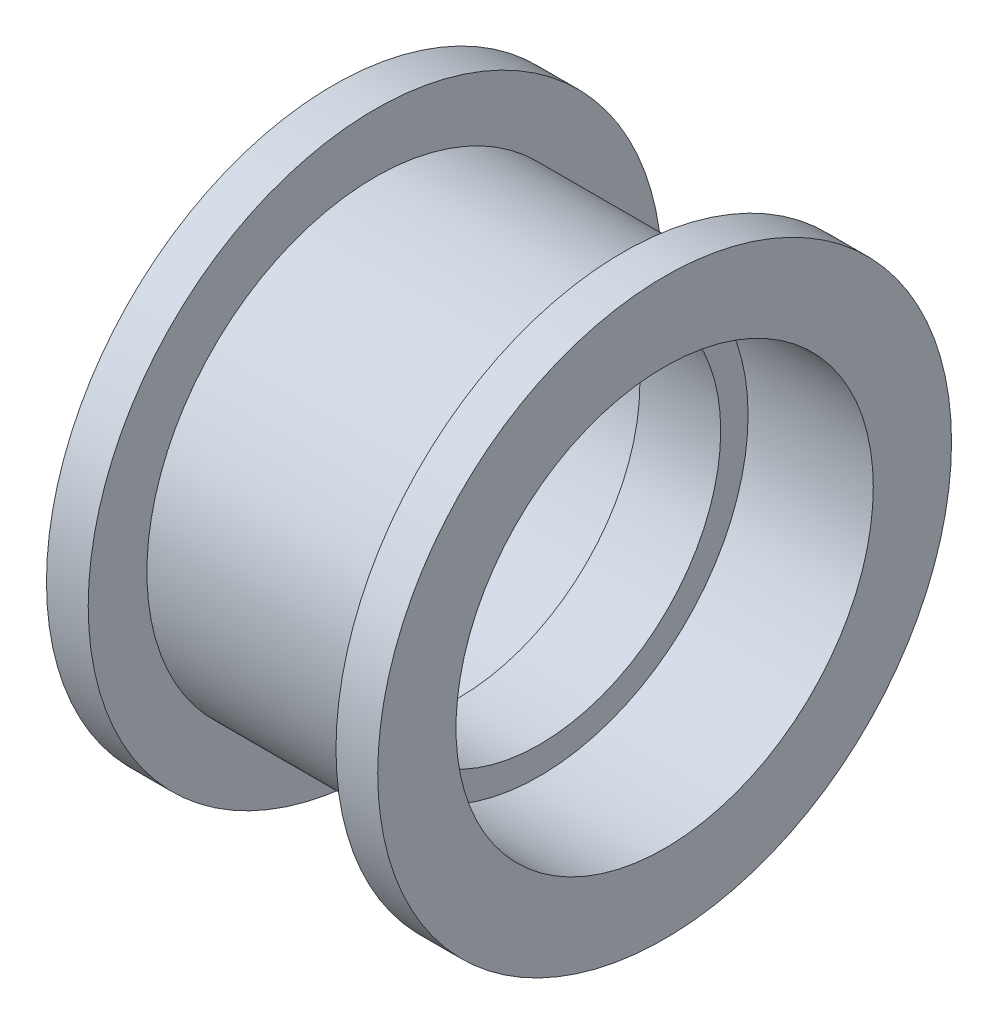
ISO-10303-21;
HEADER;
FILE_DESCRIPTION(('STEP AP214'),'2;1');
FILE_NAME('part.step','',(''),(''),'','','');
FILE_SCHEMA(('AUTOMOTIVE_DESIGN { 1 0 10303 214 1 1 1 1 }'));
ENDSEC;
DATA;
#1=APPLICATION_CONTEXT('core data for automotive mechanical design processes');
#2=APPLICATION_PROTOCOL_DEFINITION('international standard','automotive_design',2000,#1);
#3=PRODUCT_CONTEXT('',#1,'mechanical');
#4=PRODUCT('Part','Part','',(#3));
#5=PRODUCT_RELATED_PRODUCT_CATEGORY('part','',(#4));
#6=PRODUCT_DEFINITION_FORMATION('','',#4);
#7=PRODUCT_DEFINITION_CONTEXT('part definition',#1,'design');
#8=PRODUCT_DEFINITION('design','',#6,#7);
#9=PRODUCT_DEFINITION_SHAPE('','',#8);
#10=(LENGTH_UNIT() NAMED_UNIT(*) SI_UNIT(.MILLI.,.METRE.));
#11=(NAMED_UNIT(*) PLANE_ANGLE_UNIT() SI_UNIT($,.RADIAN.));
#12=(NAMED_UNIT(*) SI_UNIT($,.STERADIAN.) SOLID_ANGLE_UNIT());
#13=UNCERTAINTY_MEASURE_WITH_UNIT(LENGTH_MEASURE(1.E-05),#10,'distance_accuracy_value','');
#14=(GEOMETRIC_REPRESENTATION_CONTEXT(3) GLOBAL_UNCERTAINTY_ASSIGNED_CONTEXT((#13)) GLOBAL_UNIT_ASSIGNED_CONTEXT((#10,
#11,#12)) REPRESENTATION_CONTEXT('',''));
#15=CARTESIAN_POINT('',(0.,0.,0.));
#16=DIRECTION('',(0.,0.,1.));
#17=DIRECTION('',(1.,0.,0.));
#18=AXIS2_PLACEMENT_3D('',#15,#16,#17);
#19=CARTESIAN_POINT('',(-1.55,6.95,0.));
#20=DIRECTION('',(-1.,0.,0.));
#21=DIRECTION('',(0.,0.,1.));
#22=AXIS2_PLACEMENT_3D('',#19,#20,#21);
#23=PLANE('',#22);
#24=CARTESIAN_POINT('',(-1.55,0.,0.));
#25=DIRECTION('',(1.,0.,0.));
#26=DIRECTION('',(0.,0.,-1.));
#27=AXIS2_PLACEMENT_3D('',#24,#25,#26);
#28=CIRCLE('',#27,6.95);
#29=CARTESIAN_POINT('',(-1.55,0.,-6.95));
#30=VERTEX_POINT('',#29);
#31=EDGE_CURVE('E10',#30,#30,#28,.T.);
#32=ORIENTED_EDGE('',*,*,#31,.T.);
#33=EDGE_LOOP('',(#32));
#34=FACE_BOUND('',#33,.T.);
#35=CARTESIAN_POINT('',(-1.55,0.,0.));
#36=DIRECTION('',(1.,0.,0.));
#37=DIRECTION('',(0.,0.,-1.));
#38=AXIS2_PLACEMENT_3D('',#35,#36,#37);
#39=CIRCLE('',#38,8.);
#40=CARTESIAN_POINT('',(-1.55,0.,-8.));
#41=VERTEX_POINT('',#40);
#42=EDGE_CURVE('E74',#41,#41,#39,.T.);
#43=ORIENTED_EDGE('',*,*,#42,.F.);
#44=EDGE_LOOP('',(#43));
#45=FACE_BOUND('',#44,.T.);
#46=ADVANCED_FACE('F34',(#34,#45),#23,.T.);
#47=CARTESIAN_POINT('',(0.,0.,0.));
#48=DIRECTION('',(1.,0.,0.));
#49=DIRECTION('',(0.,0.,-1.));
#50=AXIS2_PLACEMENT_3D('',#47,#48,#49);
#51=CYLINDRICAL_SURFACE('',#50,6.95);
#52=CARTESIAN_POINT('',(1.55,0.,0.));
#53=DIRECTION('',(1.,0.,0.));
#54=DIRECTION('',(0.,0.,-1.));
#55=AXIS2_PLACEMENT_3D('',#52,#53,#54);
#56=CIRCLE('',#55,6.95);
#57=CARTESIAN_POINT('',(1.55,0.,-6.95));
#58=VERTEX_POINT('',#57);
#59=EDGE_CURVE('E40',#58,#58,#56,.T.);
#60=ORIENTED_EDGE('',*,*,#59,.T.);
#61=EDGE_LOOP('',(#60));
#62=FACE_BOUND('',#61,.T.);
#63=ORIENTED_EDGE('',*,*,#31,.F.);
#64=EDGE_LOOP('',(#63));
#65=FACE_BOUND('',#64,.T.);
#66=ADVANCED_FACE('F82',(#62,#65),#51,.F.);
#67=CARTESIAN_POINT('',(1.55,6.95,0.));
#68=DIRECTION('',(1.,0.,0.));
#69=DIRECTION('',(0.,0.,-1.));
#70=AXIS2_PLACEMENT_3D('',#67,#68,#69);
#71=PLANE('',#70);
#72=CARTESIAN_POINT('',(1.55,0.,0.));
#73=DIRECTION('',(1.,0.,0.));
#74=DIRECTION('',(0.,0.,-1.));
#75=AXIS2_PLACEMENT_3D('',#72,#73,#74);
#76=CIRCLE('',#75,8.);
#77=CARTESIAN_POINT('',(1.55,0.,-8.));
#78=VERTEX_POINT('',#77);
#79=EDGE_CURVE('E44',#78,#78,#76,.T.);
#80=ORIENTED_EDGE('',*,*,#79,.T.);
#81=EDGE_LOOP('',(#80));
#82=FACE_BOUND('',#81,.T.);
#83=ORIENTED_EDGE('',*,*,#59,.F.);
#84=EDGE_LOOP('',(#83));
#85=FACE_BOUND('',#84,.T.);
#86=ADVANCED_FACE('F86',(#82,#85),#71,.T.);
#87=CARTESIAN_POINT('',(0.,0.,0.));
#88=DIRECTION('',(1.,0.,0.));
#89=DIRECTION('',(0.,0.,-1.));
#90=AXIS2_PLACEMENT_3D('',#87,#88,#89);
#91=CYLINDRICAL_SURFACE('',#90,8.);
#92=CARTESIAN_POINT('',(6.35,0.,0.));
#93=DIRECTION('',(1.,0.,0.));
#94=DIRECTION('',(0.,0.,-1.));
#95=AXIS2_PLACEMENT_3D('',#92,#93,#94);
#96=CIRCLE('',#95,8.);
#97=CARTESIAN_POINT('',(6.35,0.,-8.));
#98=VERTEX_POINT('',#97);
#99=EDGE_CURVE('E48',#98,#98,#96,.T.);
#100=ORIENTED_EDGE('',*,*,#99,.T.);
#101=EDGE_LOOP('',(#100));
#102=FACE_BOUND('',#101,.T.);
#103=ORIENTED_EDGE('',*,*,#79,.F.);
#104=EDGE_LOOP('',(#103));
#105=FACE_BOUND('',#104,.T.);
#106=ADVANCED_FACE('F90',(#102,#105),#91,.F.);
#107=CARTESIAN_POINT('',(6.35,8.,0.));
#108=DIRECTION('',(1.,0.,0.));
#109=DIRECTION('',(0.,0.,-1.));
#110=AXIS2_PLACEMENT_3D('',#107,#108,#109);
#111=PLANE('',#110);
#112=CARTESIAN_POINT('',(6.35,0.,0.));
#113=DIRECTION('',(1.,0.,0.));
#114=DIRECTION('',(0.,0.,-1.));
#115=AXIS2_PLACEMENT_3D('',#112,#113,#114);
#116=CIRCLE('',#115,11.);
#117=CARTESIAN_POINT('',(6.35,0.,-11.));
#118=VERTEX_POINT('',#117);
#119=EDGE_CURVE('E53',#118,#118,#116,.T.);
#120=ORIENTED_EDGE('',*,*,#119,.T.);
#121=EDGE_LOOP('',(#120));
#122=FACE_BOUND('',#121,.T.);
#123=ORIENTED_EDGE('',*,*,#99,.F.);
#124=EDGE_LOOP('',(#123));
#125=FACE_BOUND('',#124,.T.);
#126=ADVANCED_FACE('F97',(#122,#125),#111,.T.);
#127=CARTESIAN_POINT('',(0.,0.,0.));
#128=DIRECTION('',(1.,0.,0.));
#129=DIRECTION('',(0.,0.,-1.));
#130=AXIS2_PLACEMENT_3D('',#127,#128,#129);
#131=CYLINDRICAL_SURFACE('',#130,11.);
#132=CARTESIAN_POINT('',(4.75,0.,0.));
#133=DIRECTION('',(1.,0.,0.));
#134=DIRECTION('',(0.,0.,-1.));
#135=AXIS2_PLACEMENT_3D('',#132,#133,#134);
#136=CIRCLE('',#135,11.);
#137=CARTESIAN_POINT('',(4.75,0.,-11.));
#138=VERTEX_POINT('',#137);
#139=EDGE_CURVE('E56',#138,#138,#136,.T.);
#140=ORIENTED_EDGE('',*,*,#139,.T.);
#141=EDGE_LOOP('',(#140));
#142=FACE_BOUND('',#141,.T.);
#143=ORIENTED_EDGE('',*,*,#119,.F.);
#144=EDGE_LOOP('',(#143));
#145=FACE_BOUND('',#144,.T.);
#146=ADVANCED_FACE('F101',(#142,#145),#131,.T.);
#147=CARTESIAN_POINT('',(4.75,11.,0.));
#148=DIRECTION('',(-1.,0.,0.));
#149=DIRECTION('',(0.,0.,1.));
#150=AXIS2_PLACEMENT_3D('',#147,#148,#149);
#151=PLANE('',#150);
#152=CARTESIAN_POINT('',(4.75,0.,0.));
#153=DIRECTION('',(1.,0.,0.));
#154=DIRECTION('',(0.,0.,-1.));
#155=AXIS2_PLACEMENT_3D('',#152,#153,#154);
#156=CIRCLE('',#155,8.75);
#157=CARTESIAN_POINT('',(4.75,0.,-8.75));
#158=VERTEX_POINT('',#157);
#159=EDGE_CURVE('E59',#158,#158,#156,.T.);
#160=ORIENTED_EDGE('',*,*,#159,.T.);
#161=EDGE_LOOP('',(#160));
#162=FACE_BOUND('',#161,.T.);
#163=ORIENTED_EDGE('',*,*,#139,.F.);
#164=EDGE_LOOP('',(#163));
#165=FACE_BOUND('',#164,.T.);
#166=ADVANCED_FACE('F105',(#162,#165),#151,.T.);
#167=CARTESIAN_POINT('',(0.,0.,0.));
#168=DIRECTION('',(1.,0.,0.));
#169=DIRECTION('',(0.,0.,-1.));
#170=AXIS2_PLACEMENT_3D('',#167,#168,#169);
#171=CYLINDRICAL_SURFACE('',#170,8.75);
#172=CARTESIAN_POINT('',(-4.75,0.,0.));
#173=DIRECTION('',(1.,0.,0.));
#174=DIRECTION('',(0.,0.,-1.));
#175=AXIS2_PLACEMENT_3D('',#172,#173,#174);
#176=CIRCLE('',#175,8.75);
#177=CARTESIAN_POINT('',(-4.75,0.,-8.75));
#178=VERTEX_POINT('',#177);
#179=EDGE_CURVE('E62',#178,#178,#176,.T.);
#180=ORIENTED_EDGE('',*,*,#179,.T.);
#181=EDGE_LOOP('',(#180));
#182=FACE_BOUND('',#181,.T.);
#183=ORIENTED_EDGE('',*,*,#159,.F.);
#184=EDGE_LOOP('',(#183));
#185=FACE_BOUND('',#184,.T.);
#186=ADVANCED_FACE('F109',(#182,#185),#171,.T.);
#187=CARTESIAN_POINT('',(-4.75,11.,0.));
#188=DIRECTION('',(1.,0.,0.));
#189=DIRECTION('',(0.,0.,-1.));
#190=AXIS2_PLACEMENT_3D('',#187,#188,#189);
#191=PLANE('',#190);
#192=CARTESIAN_POINT('',(-4.75,0.,0.));
#193=DIRECTION('',(1.,0.,0.));
#194=DIRECTION('',(0.,0.,-1.));
#195=AXIS2_PLACEMENT_3D('',#192,#193,#194);
#196=CIRCLE('',#195,11.);
#197=CARTESIAN_POINT('',(-4.75,0.,-11.));
#198=VERTEX_POINT('',#197);
#199=EDGE_CURVE('E65',#198,#198,#196,.T.);
#200=ORIENTED_EDGE('',*,*,#199,.T.);
#201=EDGE_LOOP('',(#200));
#202=FACE_BOUND('',#201,.T.);
#203=ORIENTED_EDGE('',*,*,#179,.F.);
#204=EDGE_LOOP('',(#203));
#205=FACE_BOUND('',#204,.T.);
#206=ADVANCED_FACE('F113',(#202,#205),#191,.T.);
#207=CARTESIAN_POINT('',(0.,0.,0.));
#208=DIRECTION('',(1.,0.,0.));
#209=DIRECTION('',(0.,0.,-1.));
#210=AXIS2_PLACEMENT_3D('',#207,#208,#209);
#211=CYLINDRICAL_SURFACE('',#210,11.);
#212=CARTESIAN_POINT('',(-6.35,0.,0.));
#213=DIRECTION('',(1.,0.,0.));
#214=DIRECTION('',(0.,0.,-1.));
#215=AXIS2_PLACEMENT_3D('',#212,#213,#214);
#216=CIRCLE('',#215,11.);
#217=CARTESIAN_POINT('',(-6.35,0.,-11.));
#218=VERTEX_POINT('',#217);
#219=EDGE_CURVE('E68',#218,#218,#216,.T.);
#220=ORIENTED_EDGE('',*,*,#219,.T.);
#221=EDGE_LOOP('',(#220));
#222=FACE_BOUND('',#221,.T.);
#223=ORIENTED_EDGE('',*,*,#199,.F.);
#224=EDGE_LOOP('',(#223));
#225=FACE_BOUND('',#224,.T.);
#226=ADVANCED_FACE('F117',(#222,#225),#211,.T.);
#227=CARTESIAN_POINT('',(-6.35,8.,0.));
#228=DIRECTION('',(-1.,0.,0.));
#229=DIRECTION('',(0.,0.,1.));
#230=AXIS2_PLACEMENT_3D('',#227,#228,#229);
#231=PLANE('',#230);
#232=CARTESIAN_POINT('',(-6.35,0.,0.));
#233=DIRECTION('',(1.,0.,0.));
#234=DIRECTION('',(0.,0.,-1.));
#235=AXIS2_PLACEMENT_3D('',#232,#233,#234);
#236=CIRCLE('',#235,8.);
#237=CARTESIAN_POINT('',(-6.35,0.,-8.));
#238=VERTEX_POINT('',#237);
#239=EDGE_CURVE('E71',#238,#238,#236,.T.);
#240=ORIENTED_EDGE('',*,*,#239,.T.);
#241=EDGE_LOOP('',(#240));
#242=FACE_BOUND('',#241,.T.);
#243=ORIENTED_EDGE('',*,*,#219,.F.);
#244=EDGE_LOOP('',(#243));
#245=FACE_BOUND('',#244,.T.);
#246=ADVANCED_FACE('F121',(#242,#245),#231,.T.);
#247=CARTESIAN_POINT('',(0.,0.,0.));
#248=DIRECTION('',(1.,0.,0.));
#249=DIRECTION('',(0.,0.,-1.));
#250=AXIS2_PLACEMENT_3D('',#247,#248,#249);
#251=CYLINDRICAL_SURFACE('',#250,8.);
#252=ORIENTED_EDGE('',*,*,#42,.T.);
#253=EDGE_LOOP('',(#252));
#254=FACE_BOUND('',#253,.T.);
#255=ORIENTED_EDGE('',*,*,#239,.F.);
#256=EDGE_LOOP('',(#255));
#257=FACE_BOUND('',#256,.T.);
#258=ADVANCED_FACE('F78',(#254,#257),#251,.F.);
#259=CLOSED_SHELL('',(#46,#66,#86,#106,#126,#146,#166,#186,#206,#226,#246,#258));
#260=MANIFOLD_SOLID_BREP('B2',#259);
#261=ADVANCED_BREP_SHAPE_REPRESENTATION('',(#18,#260),#14);
#262=SHAPE_DEFINITION_REPRESENTATION(#9,#261);
ENDSEC;
END-ISO-10303-21;
